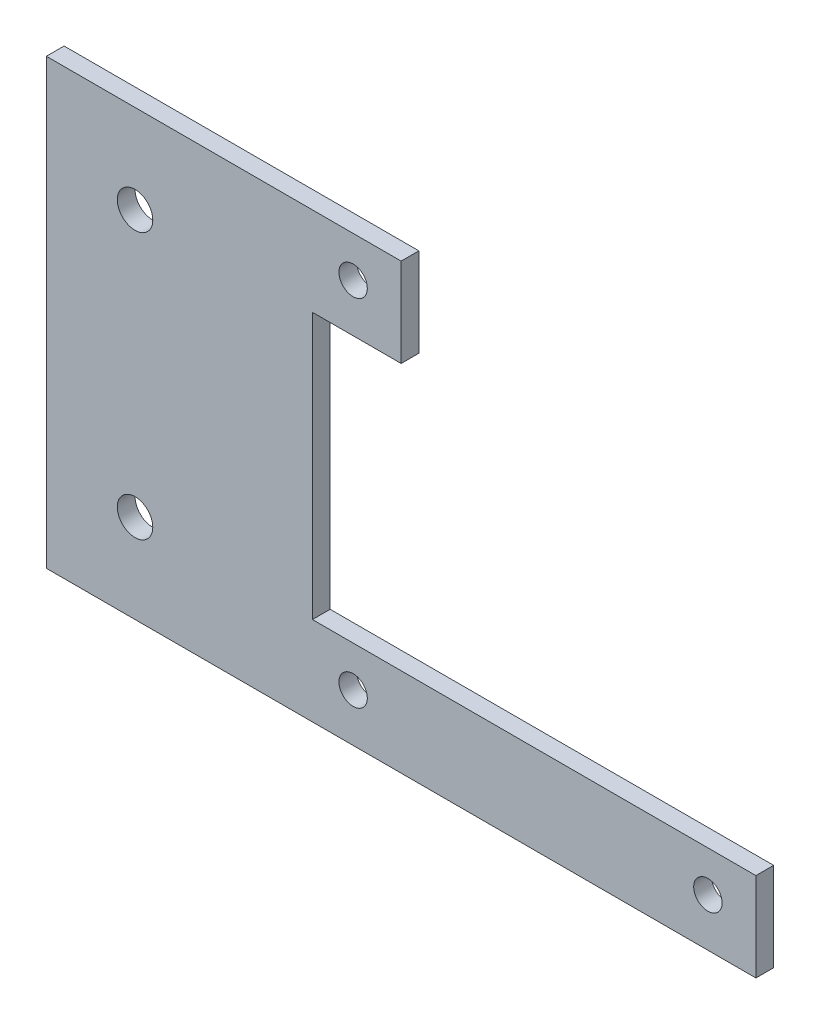
ISO-10303-21;
HEADER;
FILE_DESCRIPTION(('STEP AP214'),'2;1');
FILE_NAME('part.step','',(''),(''),'','','');
FILE_SCHEMA(('AUTOMOTIVE_DESIGN { 1 0 10303 214 1 1 1 1 }'));
ENDSEC;
DATA;
#1=APPLICATION_CONTEXT('core data for automotive mechanical design processes');
#2=APPLICATION_PROTOCOL_DEFINITION('international standard','automotive_design',2000,#1);
#3=PRODUCT_CONTEXT('',#1,'mechanical');
#4=PRODUCT('Part','Part','',(#3));
#5=PRODUCT_RELATED_PRODUCT_CATEGORY('part','',(#4));
#6=PRODUCT_DEFINITION_FORMATION('','',#4);
#7=PRODUCT_DEFINITION_CONTEXT('part definition',#1,'design');
#8=PRODUCT_DEFINITION('design','',#6,#7);
#9=PRODUCT_DEFINITION_SHAPE('','',#8);
#10=(LENGTH_UNIT() NAMED_UNIT(*) SI_UNIT(.MILLI.,.METRE.));
#11=(NAMED_UNIT(*) PLANE_ANGLE_UNIT() SI_UNIT($,.RADIAN.));
#12=(NAMED_UNIT(*) SI_UNIT($,.STERADIAN.) SOLID_ANGLE_UNIT());
#13=UNCERTAINTY_MEASURE_WITH_UNIT(LENGTH_MEASURE(1.E-05),#10,'distance_accuracy_value','');
#14=(GEOMETRIC_REPRESENTATION_CONTEXT(3) GLOBAL_UNCERTAINTY_ASSIGNED_CONTEXT((#13)) GLOBAL_UNIT_ASSIGNED_CONTEXT((#10,
#11,#12)) REPRESENTATION_CONTEXT('',''));
#15=CARTESIAN_POINT('',(0.,0.,0.));
#16=DIRECTION('',(0.,0.,1.));
#17=DIRECTION('',(1.,0.,0.));
#18=AXIS2_PLACEMENT_3D('',#15,#16,#17);
#19=CARTESIAN_POINT('',(0.,0.,2.));
#20=DIRECTION('',(0.,0.,1.));
#21=DIRECTION('',(1.,0.,0.));
#22=AXIS2_PLACEMENT_3D('',#19,#20,#21);
#23=PLANE('',#22);
#24=CARTESIAN_POINT('',(24.5871875228641,-39.5312427562463,2.));
#25=DIRECTION('',(0.,0.,1.));
#26=DIRECTION('',(1.,0.,0.));
#27=AXIS2_PLACEMENT_3D('',#24,#25,#26);
#28=CIRCLE('',#27,1.6);
#29=CARTESIAN_POINT('',(26.1871875228641,-39.5312427562463,2.));
#30=VERTEX_POINT('',#29);
#31=EDGE_CURVE('E194',#30,#30,#28,.T.);
#32=ORIENTED_EDGE('',*,*,#31,.F.);
#33=EDGE_LOOP('',(#32));
#34=FACE_BOUND('',#33,.T.);
#35=CARTESIAN_POINT('',(64.5871875228641,-79.5312427562463,2.));
#36=DIRECTION('',(0.,0.,1.));
#37=DIRECTION('',(1.,0.,0.));
#38=AXIS2_PLACEMENT_3D('',#35,#36,#37);
#39=CIRCLE('',#38,1.60000000000001);
#40=CARTESIAN_POINT('',(66.1871875228641,-79.5312427562463,2.));
#41=VERTEX_POINT('',#40);
#42=EDGE_CURVE('E182',#41,#41,#39,.T.);
#43=ORIENTED_EDGE('',*,*,#42,.F.);
#44=EDGE_LOOP('',(#43));
#45=FACE_BOUND('',#44,.T.);
#46=DIRECTION('',(-1.,0.,0.));
#47=VECTOR('',#46,1.);
#48=CARTESIAN_POINT('',(30.,-34.9440552333823,2.));
#49=LINE('',#48,#47);
#50=CARTESIAN_POINT('',(30.,-34.9440552333823,2.));
#51=VERTEX_POINT('',#50);
#52=CARTESIAN_POINT('',(-10.,-34.9440552333823,2.));
#53=VERTEX_POINT('',#52);
#54=EDGE_CURVE('E145',#51,#53,#49,.T.);
#55=ORIENTED_EDGE('',*,*,#54,.T.);
#56=DIRECTION('',(0.,-1.,0.));
#57=VECTOR('',#56,1.);
#58=CARTESIAN_POINT('',(-10.,-34.9440552333823,2.));
#59=LINE('',#58,#57);
#60=CARTESIAN_POINT('',(-10.,-84.9440552333823,2.));
#61=VERTEX_POINT('',#60);
#62=EDGE_CURVE('E93',#53,#61,#59,.T.);
#63=ORIENTED_EDGE('',*,*,#62,.T.);
#64=DIRECTION('',(1.,0.,0.));
#65=VECTOR('',#64,1.);
#66=CARTESIAN_POINT('',(-10.,-84.9440552333823,2.));
#67=LINE('',#66,#65);
#68=CARTESIAN_POINT('',(70.,-84.9440552333823,2.));
#69=VERTEX_POINT('',#68);
#70=EDGE_CURVE('E160',#61,#69,#67,.T.);
#71=ORIENTED_EDGE('',*,*,#70,.T.);
#72=DIRECTION('',(0.,1.,0.));
#73=VECTOR('',#72,1.);
#74=CARTESIAN_POINT('',(70.,-84.9440552333823,2.));
#75=LINE('',#74,#73);
#76=CARTESIAN_POINT('',(70.,-74.9440552333823,2.));
#77=VERTEX_POINT('',#76);
#78=EDGE_CURVE('E173',#69,#77,#75,.T.);
#79=ORIENTED_EDGE('',*,*,#78,.T.);
#80=DIRECTION('',(-1.,0.,0.));
#81=VECTOR('',#80,1.);
#82=CARTESIAN_POINT('',(70.,-74.9440552333823,2.));
#83=LINE('',#82,#81);
#84=CARTESIAN_POINT('',(20.,-74.9440552333823,2.));
#85=VERTEX_POINT('',#84);
#86=EDGE_CURVE('E112',#77,#85,#83,.T.);
#87=ORIENTED_EDGE('',*,*,#86,.T.);
#88=DIRECTION('',(0.,1.,0.));
#89=VECTOR('',#88,1.);
#90=CARTESIAN_POINT('',(20.,-74.9440552333823,2.));
#91=LINE('',#90,#89);
#92=CARTESIAN_POINT('',(20.,-44.9440552333823,2.));
#93=VERTEX_POINT('',#92);
#94=EDGE_CURVE('E106',#85,#93,#91,.T.);
#95=ORIENTED_EDGE('',*,*,#94,.T.);
#96=DIRECTION('',(1.,0.,0.));
#97=VECTOR('',#96,1.);
#98=CARTESIAN_POINT('',(30.,-44.9440552333823,2.));
#99=LINE('',#98,#97);
#100=CARTESIAN_POINT('',(30.,-44.9440552333823,2.));
#101=VERTEX_POINT('',#100);
#102=EDGE_CURVE('E110',#93,#101,#99,.T.);
#103=ORIENTED_EDGE('',*,*,#102,.T.);
#104=DIRECTION('',(0.,1.,0.));
#105=VECTOR('',#104,1.);
#106=CARTESIAN_POINT('',(30.,-44.9440552333823,2.));
#107=LINE('',#106,#105);
#108=EDGE_CURVE('E50',#101,#51,#107,.T.);
#109=ORIENTED_EDGE('',*,*,#108,.T.);
#110=EDGE_LOOP('',(#55,#63,#71,#79,#87,#95,#103,#109));
#111=FACE_BOUND('',#110,.T.);
#112=CARTESIAN_POINT('',(24.5871875228641,-79.5312427562463,2.));
#113=DIRECTION('',(0.,0.,1.));
#114=DIRECTION('',(1.,0.,0.));
#115=AXIS2_PLACEMENT_3D('',#112,#113,#114);
#116=CIRCLE('',#115,1.6);
#117=CARTESIAN_POINT('',(26.1871875228641,-79.5312427562463,2.));
#118=VERTEX_POINT('',#117);
#119=EDGE_CURVE('E134',#118,#118,#116,.T.);
#120=ORIENTED_EDGE('',*,*,#119,.F.);
#121=EDGE_LOOP('',(#120));
#122=FACE_BOUND('',#121,.T.);
#123=CARTESIAN_POINT('',(0.,-74.9440552333823,2.));
#124=DIRECTION('',(0.,0.,1.));
#125=DIRECTION('',(1.,0.,0.));
#126=AXIS2_PLACEMENT_3D('',#123,#124,#125);
#127=CIRCLE('',#126,2.);
#128=CARTESIAN_POINT('',(2.,-74.9440552333823,2.));
#129=VERTEX_POINT('',#128);
#130=EDGE_CURVE('E188',#129,#129,#127,.T.);
#131=ORIENTED_EDGE('',*,*,#130,.F.);
#132=EDGE_LOOP('',(#131));
#133=FACE_BOUND('',#132,.T.);
#134=CARTESIAN_POINT('',(0.,-44.9440552333823,2.));
#135=DIRECTION('',(0.,0.,1.));
#136=DIRECTION('',(1.,0.,0.));
#137=AXIS2_PLACEMENT_3D('',#134,#135,#136);
#138=CIRCLE('',#137,2.);
#139=CARTESIAN_POINT('',(2.,-44.9440552333823,2.));
#140=VERTEX_POINT('',#139);
#141=EDGE_CURVE('E200',#140,#140,#138,.T.);
#142=ORIENTED_EDGE('',*,*,#141,.F.);
#143=EDGE_LOOP('',(#142));
#144=FACE_BOUND('',#143,.T.);
#145=ADVANCED_FACE('F33',(#34,#45,#111,#122,#133,#144),#23,.T.);
#146=CARTESIAN_POINT('',(0.,0.,0.));
#147=DIRECTION('',(0.,0.,1.));
#148=DIRECTION('',(1.,0.,0.));
#149=AXIS2_PLACEMENT_3D('',#146,#147,#148);
#150=PLANE('',#149);
#151=DIRECTION('',(-1.,0.,0.));
#152=VECTOR('',#151,1.);
#153=CARTESIAN_POINT('',(30.,-34.9440552333823,0.));
#154=LINE('',#153,#152);
#155=CARTESIAN_POINT('',(30.,-34.9440552333823,0.));
#156=VERTEX_POINT('',#155);
#157=CARTESIAN_POINT('',(-10.,-34.9440552333823,0.));
#158=VERTEX_POINT('',#157);
#159=EDGE_CURVE('E130',#156,#158,#154,.T.);
#160=ORIENTED_EDGE('',*,*,#159,.F.);
#161=DIRECTION('',(0.,1.,0.));
#162=VECTOR('',#161,1.);
#163=CARTESIAN_POINT('',(30.,-44.9440552333823,0.));
#164=LINE('',#163,#162);
#165=CARTESIAN_POINT('',(30.,-44.9440552333823,0.));
#166=VERTEX_POINT('',#165);
#167=EDGE_CURVE('E85',#166,#156,#164,.T.);
#168=ORIENTED_EDGE('',*,*,#167,.F.);
#169=DIRECTION('',(1.,0.,0.));
#170=VECTOR('',#169,1.);
#171=CARTESIAN_POINT('',(30.,-44.9440552333823,0.));
#172=LINE('',#171,#170);
#173=CARTESIAN_POINT('',(20.,-44.9440552333823,0.));
#174=VERTEX_POINT('',#173);
#175=EDGE_CURVE('E79',#174,#166,#172,.T.);
#176=ORIENTED_EDGE('',*,*,#175,.F.);
#177=DIRECTION('',(0.,1.,0.));
#178=VECTOR('',#177,1.);
#179=CARTESIAN_POINT('',(20.,-74.9440552333823,0.));
#180=LINE('',#179,#178);
#181=CARTESIAN_POINT('',(20.,-74.9440552333823,0.));
#182=VERTEX_POINT('',#181);
#183=EDGE_CURVE('E120',#182,#174,#180,.T.);
#184=ORIENTED_EDGE('',*,*,#183,.F.);
#185=DIRECTION('',(-1.,0.,0.));
#186=VECTOR('',#185,1.);
#187=CARTESIAN_POINT('',(70.,-74.9440552333823,0.));
#188=LINE('',#187,#186);
#189=CARTESIAN_POINT('',(70.,-74.9440552333823,0.));
#190=VERTEX_POINT('',#189);
#191=EDGE_CURVE('E140',#190,#182,#188,.T.);
#192=ORIENTED_EDGE('',*,*,#191,.F.);
#193=DIRECTION('',(0.,1.,0.));
#194=VECTOR('',#193,1.);
#195=CARTESIAN_POINT('',(70.,-84.9440552333823,0.));
#196=LINE('',#195,#194);
#197=CARTESIAN_POINT('',(70.,-84.9440552333823,0.));
#198=VERTEX_POINT('',#197);
#199=EDGE_CURVE('E138',#198,#190,#196,.T.);
#200=ORIENTED_EDGE('',*,*,#199,.F.);
#201=DIRECTION('',(1.,0.,0.));
#202=VECTOR('',#201,1.);
#203=CARTESIAN_POINT('',(-10.,-84.9440552333823,0.));
#204=LINE('',#203,#202);
#205=CARTESIAN_POINT('',(-10.,-84.9440552333823,0.));
#206=VERTEX_POINT('',#205);
#207=EDGE_CURVE('E136',#206,#198,#204,.T.);
#208=ORIENTED_EDGE('',*,*,#207,.F.);
#209=DIRECTION('',(0.,-1.,0.));
#210=VECTOR('',#209,1.);
#211=CARTESIAN_POINT('',(-10.,-34.9440552333823,0.));
#212=LINE('',#211,#210);
#213=EDGE_CURVE('E133',#158,#206,#212,.T.);
#214=ORIENTED_EDGE('',*,*,#213,.F.);
#215=EDGE_LOOP('',(#160,#168,#176,#184,#192,#200,#208,#214));
#216=FACE_BOUND('',#215,.T.);
#217=CARTESIAN_POINT('',(24.5871875228641,-79.5312427562463,0.));
#218=DIRECTION('',(0.,0.,1.));
#219=DIRECTION('',(1.,0.,0.));
#220=AXIS2_PLACEMENT_3D('',#217,#218,#219);
#221=CIRCLE('',#220,1.6);
#222=CARTESIAN_POINT('',(26.1871875228641,-79.5312427562463,0.));
#223=VERTEX_POINT('',#222);
#224=EDGE_CURVE('E179',#223,#223,#221,.T.);
#225=ORIENTED_EDGE('',*,*,#224,.T.);
#226=EDGE_LOOP('',(#225));
#227=FACE_BOUND('',#226,.T.);
#228=CARTESIAN_POINT('',(64.5871875228641,-79.5312427562463,0.));
#229=DIRECTION('',(0.,0.,1.));
#230=DIRECTION('',(1.,0.,0.));
#231=AXIS2_PLACEMENT_3D('',#228,#229,#230);
#232=CIRCLE('',#231,1.60000000000001);
#233=CARTESIAN_POINT('',(66.1871875228641,-79.5312427562463,0.));
#234=VERTEX_POINT('',#233);
#235=EDGE_CURVE('E185',#234,#234,#232,.T.);
#236=ORIENTED_EDGE('',*,*,#235,.T.);
#237=EDGE_LOOP('',(#236));
#238=FACE_BOUND('',#237,.T.);
#239=CARTESIAN_POINT('',(0.,-74.9440552333823,0.));
#240=DIRECTION('',(0.,0.,1.));
#241=DIRECTION('',(1.,0.,0.));
#242=AXIS2_PLACEMENT_3D('',#239,#240,#241);
#243=CIRCLE('',#242,2.);
#244=CARTESIAN_POINT('',(2.,-74.9440552333823,0.));
#245=VERTEX_POINT('',#244);
#246=EDGE_CURVE('E191',#245,#245,#243,.T.);
#247=ORIENTED_EDGE('',*,*,#246,.T.);
#248=EDGE_LOOP('',(#247));
#249=FACE_BOUND('',#248,.T.);
#250=CARTESIAN_POINT('',(24.5871875228641,-39.5312427562463,0.));
#251=DIRECTION('',(0.,0.,1.));
#252=DIRECTION('',(1.,0.,0.));
#253=AXIS2_PLACEMENT_3D('',#250,#251,#252);
#254=CIRCLE('',#253,1.6);
#255=CARTESIAN_POINT('',(26.1871875228641,-39.5312427562463,0.));
#256=VERTEX_POINT('',#255);
#257=EDGE_CURVE('E197',#256,#256,#254,.T.);
#258=ORIENTED_EDGE('',*,*,#257,.T.);
#259=EDGE_LOOP('',(#258));
#260=FACE_BOUND('',#259,.T.);
#261=CARTESIAN_POINT('',(0.,-44.9440552333823,0.));
#262=DIRECTION('',(0.,0.,1.));
#263=DIRECTION('',(1.,0.,0.));
#264=AXIS2_PLACEMENT_3D('',#261,#262,#263);
#265=CIRCLE('',#264,2.);
#266=CARTESIAN_POINT('',(2.,-44.9440552333823,0.));
#267=VERTEX_POINT('',#266);
#268=EDGE_CURVE('E203',#267,#267,#265,.T.);
#269=ORIENTED_EDGE('',*,*,#268,.T.);
#270=EDGE_LOOP('',(#269));
#271=FACE_BOUND('',#270,.T.);
#272=ADVANCED_FACE('F164',(#216,#227,#238,#249,#260,#271),#150,.F.);
#273=CARTESIAN_POINT('',(30.,-34.9440552333823,2.));
#274=DIRECTION('',(0.,-1.,0.));
#275=DIRECTION('',(1.,0.,0.));
#276=AXIS2_PLACEMENT_3D('',#273,#274,#275);
#277=PLANE('',#276);
#278=ORIENTED_EDGE('',*,*,#159,.T.);
#279=DIRECTION('',(0.,0.,-1.));
#280=VECTOR('',#279,1.);
#281=CARTESIAN_POINT('',(-10.,-34.9440552333823,2.));
#282=LINE('',#281,#280);
#283=EDGE_CURVE('E11',#53,#158,#282,.T.);
#284=ORIENTED_EDGE('',*,*,#283,.F.);
#285=ORIENTED_EDGE('',*,*,#54,.F.);
#286=DIRECTION('',(0.,0.,-1.));
#287=VECTOR('',#286,1.);
#288=CARTESIAN_POINT('',(30.,-34.9440552333823,2.));
#289=LINE('',#288,#287);
#290=EDGE_CURVE('E126',#51,#156,#289,.T.);
#291=ORIENTED_EDGE('',*,*,#290,.T.);
#292=EDGE_LOOP('',(#278,#284,#285,#291));
#293=FACE_BOUND('',#292,.T.);
#294=ADVANCED_FACE('F35',(#293),#277,.F.);
#295=CARTESIAN_POINT('',(-10.,-34.9440552333823,2.));
#296=DIRECTION('',(1.,0.,0.));
#297=DIRECTION('',(0.,1.,0.));
#298=AXIS2_PLACEMENT_3D('',#295,#296,#297);
#299=PLANE('',#298);
#300=ORIENTED_EDGE('',*,*,#213,.T.);
#301=DIRECTION('',(0.,0.,-1.));
#302=VECTOR('',#301,1.);
#303=CARTESIAN_POINT('',(-10.,-84.9440552333823,2.));
#304=LINE('',#303,#302);
#305=EDGE_CURVE('E42',#61,#206,#304,.T.);
#306=ORIENTED_EDGE('',*,*,#305,.F.);
#307=ORIENTED_EDGE('',*,*,#62,.F.);
#308=ORIENTED_EDGE('',*,*,#283,.T.);
#309=EDGE_LOOP('',(#300,#306,#307,#308));
#310=FACE_BOUND('',#309,.T.);
#311=ADVANCED_FACE('F237',(#310),#299,.F.);
#312=CARTESIAN_POINT('',(-10.,-84.9440552333823,2.));
#313=DIRECTION('',(0.,1.,0.));
#314=DIRECTION('',(0.,0.,1.));
#315=AXIS2_PLACEMENT_3D('',#312,#313,#314);
#316=PLANE('',#315);
#317=ORIENTED_EDGE('',*,*,#207,.T.);
#318=DIRECTION('',(0.,0.,-1.));
#319=VECTOR('',#318,1.);
#320=CARTESIAN_POINT('',(70.,-84.9440552333823,2.));
#321=LINE('',#320,#319);
#322=EDGE_CURVE('E152',#69,#198,#321,.T.);
#323=ORIENTED_EDGE('',*,*,#322,.F.);
#324=ORIENTED_EDGE('',*,*,#70,.F.);
#325=ORIENTED_EDGE('',*,*,#305,.T.);
#326=EDGE_LOOP('',(#317,#323,#324,#325));
#327=FACE_BOUND('',#326,.T.);
#328=ADVANCED_FACE('F158',(#327),#316,.F.);
#329=CARTESIAN_POINT('',(70.,-84.9440552333823,2.));
#330=DIRECTION('',(-1.,0.,0.));
#331=DIRECTION('',(0.,0.,1.));
#332=AXIS2_PLACEMENT_3D('',#329,#330,#331);
#333=PLANE('',#332);
#334=ORIENTED_EDGE('',*,*,#199,.T.);
#335=DIRECTION('',(0.,0.,-1.));
#336=VECTOR('',#335,1.);
#337=CARTESIAN_POINT('',(70.,-74.9440552333823,2.));
#338=LINE('',#337,#336);
#339=EDGE_CURVE('E149',#77,#190,#338,.T.);
#340=ORIENTED_EDGE('',*,*,#339,.F.);
#341=ORIENTED_EDGE('',*,*,#78,.F.);
#342=ORIENTED_EDGE('',*,*,#322,.T.);
#343=EDGE_LOOP('',(#334,#340,#341,#342));
#344=FACE_BOUND('',#343,.T.);
#345=ADVANCED_FACE('F169',(#344),#333,.F.);
#346=CARTESIAN_POINT('',(70.,-74.9440552333823,2.));
#347=DIRECTION('',(0.,-1.,0.));
#348=DIRECTION('',(0.,0.,-1.));
#349=AXIS2_PLACEMENT_3D('',#346,#347,#348);
#350=PLANE('',#349);
#351=ORIENTED_EDGE('',*,*,#191,.T.);
#352=DIRECTION('',(0.,0.,-1.));
#353=VECTOR('',#352,1.);
#354=CARTESIAN_POINT('',(20.,-74.9440552333823,2.));
#355=LINE('',#354,#353);
#356=EDGE_CURVE('E121',#85,#182,#355,.T.);
#357=ORIENTED_EDGE('',*,*,#356,.F.);
#358=ORIENTED_EDGE('',*,*,#86,.F.);
#359=ORIENTED_EDGE('',*,*,#339,.T.);
#360=EDGE_LOOP('',(#351,#357,#358,#359));
#361=FACE_BOUND('',#360,.T.);
#362=ADVANCED_FACE('F172',(#361),#350,.F.);
#363=CARTESIAN_POINT('',(20.,-74.9440552333823,2.));
#364=DIRECTION('',(-1.,0.,0.));
#365=DIRECTION('',(0.,-1.,0.));
#366=AXIS2_PLACEMENT_3D('',#363,#364,#365);
#367=PLANE('',#366);
#368=ORIENTED_EDGE('',*,*,#183,.T.);
#369=DIRECTION('',(0.,0.,-1.));
#370=VECTOR('',#369,1.);
#371=CARTESIAN_POINT('',(20.,-44.9440552333823,2.));
#372=LINE('',#371,#370);
#373=EDGE_CURVE('E117',#93,#174,#372,.T.);
#374=ORIENTED_EDGE('',*,*,#373,.F.);
#375=ORIENTED_EDGE('',*,*,#94,.F.);
#376=ORIENTED_EDGE('',*,*,#356,.T.);
#377=EDGE_LOOP('',(#368,#374,#375,#376));
#378=FACE_BOUND('',#377,.T.);
#379=ADVANCED_FACE('F118',(#378),#367,.F.);
#380=CARTESIAN_POINT('',(30.,-44.9440552333823,2.));
#381=DIRECTION('',(0.,1.,0.));
#382=DIRECTION('',(0.,0.,1.));
#383=AXIS2_PLACEMENT_3D('',#380,#381,#382);
#384=PLANE('',#383);
#385=ORIENTED_EDGE('',*,*,#175,.T.);
#386=DIRECTION('',(0.,0.,-1.));
#387=VECTOR('',#386,1.);
#388=CARTESIAN_POINT('',(30.,-44.9440552333823,2.));
#389=LINE('',#388,#387);
#390=EDGE_CURVE('E122',#101,#166,#389,.T.);
#391=ORIENTED_EDGE('',*,*,#390,.F.);
#392=ORIENTED_EDGE('',*,*,#102,.F.);
#393=ORIENTED_EDGE('',*,*,#373,.T.);
#394=EDGE_LOOP('',(#385,#391,#392,#393));
#395=FACE_BOUND('',#394,.T.);
#396=ADVANCED_FACE('F124',(#395),#384,.F.);
#397=CARTESIAN_POINT('',(30.,-44.9440552333823,2.));
#398=DIRECTION('',(-1.,0.,0.));
#399=DIRECTION('',(0.,-1.,0.));
#400=AXIS2_PLACEMENT_3D('',#397,#398,#399);
#401=PLANE('',#400);
#402=ORIENTED_EDGE('',*,*,#167,.T.);
#403=ORIENTED_EDGE('',*,*,#290,.F.);
#404=ORIENTED_EDGE('',*,*,#108,.F.);
#405=ORIENTED_EDGE('',*,*,#390,.T.);
#406=EDGE_LOOP('',(#402,#403,#404,#405));
#407=FACE_BOUND('',#406,.T.);
#408=ADVANCED_FACE('F225',(#407),#401,.F.);
#409=CARTESIAN_POINT('',(24.5871875228641,-79.5312427562463,2.));
#410=DIRECTION('',(0.,0.,-1.));
#411=DIRECTION('',(-1.,0.,0.));
#412=AXIS2_PLACEMENT_3D('',#409,#410,#411);
#413=CYLINDRICAL_SURFACE('',#412,1.6);
#414=ORIENTED_EDGE('',*,*,#119,.T.);
#415=EDGE_LOOP('',(#414));
#416=FACE_BOUND('',#415,.T.);
#417=ORIENTED_EDGE('',*,*,#224,.F.);
#418=EDGE_LOOP('',(#417));
#419=FACE_BOUND('',#418,.T.);
#420=ADVANCED_FACE('F222',(#416,#419),#413,.F.);
#421=CARTESIAN_POINT('',(64.5871875228641,-79.5312427562463,2.));
#422=DIRECTION('',(0.,0.,-1.));
#423=DIRECTION('',(-1.,0.,0.));
#424=AXIS2_PLACEMENT_3D('',#421,#422,#423);
#425=CYLINDRICAL_SURFACE('',#424,1.60000000000001);
#426=ORIENTED_EDGE('',*,*,#42,.T.);
#427=EDGE_LOOP('',(#426));
#428=FACE_BOUND('',#427,.T.);
#429=ORIENTED_EDGE('',*,*,#235,.F.);
#430=EDGE_LOOP('',(#429));
#431=FACE_BOUND('',#430,.T.);
#432=ADVANCED_FACE('F301',(#428,#431),#425,.F.);
#433=CARTESIAN_POINT('',(0.,-74.9440552333823,2.));
#434=DIRECTION('',(0.,0.,-1.));
#435=DIRECTION('',(-1.,0.,0.));
#436=AXIS2_PLACEMENT_3D('',#433,#434,#435);
#437=CYLINDRICAL_SURFACE('',#436,2.);
#438=ORIENTED_EDGE('',*,*,#130,.T.);
#439=EDGE_LOOP('',(#438));
#440=FACE_BOUND('',#439,.T.);
#441=ORIENTED_EDGE('',*,*,#246,.F.);
#442=EDGE_LOOP('',(#441));
#443=FACE_BOUND('',#442,.T.);
#444=ADVANCED_FACE('F309',(#440,#443),#437,.F.);
#445=CARTESIAN_POINT('',(24.5871875228641,-39.5312427562463,2.));
#446=DIRECTION('',(0.,0.,-1.));
#447=DIRECTION('',(-1.,0.,0.));
#448=AXIS2_PLACEMENT_3D('',#445,#446,#447);
#449=CYLINDRICAL_SURFACE('',#448,1.6);
#450=ORIENTED_EDGE('',*,*,#31,.T.);
#451=EDGE_LOOP('',(#450));
#452=FACE_BOUND('',#451,.T.);
#453=ORIENTED_EDGE('',*,*,#257,.F.);
#454=EDGE_LOOP('',(#453));
#455=FACE_BOUND('',#454,.T.);
#456=ADVANCED_FACE('F317',(#452,#455),#449,.F.);
#457=CARTESIAN_POINT('',(0.,-44.9440552333823,2.));
#458=DIRECTION('',(0.,0.,-1.));
#459=DIRECTION('',(-1.,0.,0.));
#460=AXIS2_PLACEMENT_3D('',#457,#458,#459);
#461=CYLINDRICAL_SURFACE('',#460,2.);
#462=ORIENTED_EDGE('',*,*,#141,.T.);
#463=EDGE_LOOP('',(#462));
#464=FACE_BOUND('',#463,.T.);
#465=ORIENTED_EDGE('',*,*,#268,.F.);
#466=EDGE_LOOP('',(#465));
#467=FACE_BOUND('',#466,.T.);
#468=ADVANCED_FACE('F209',(#464,#467),#461,.F.);
#469=CLOSED_SHELL('',(#145,#272,#294,#311,#328,#345,#362,#379,#396,#408,#420,#432,#444,#456,#468));
#470=MANIFOLD_SOLID_BREP('B2',#469);
#471=ADVANCED_BREP_SHAPE_REPRESENTATION('',(#18,#470),#14);
#472=SHAPE_DEFINITION_REPRESENTATION(#9,#471);
ENDSEC;
END-ISO-10303-21;
